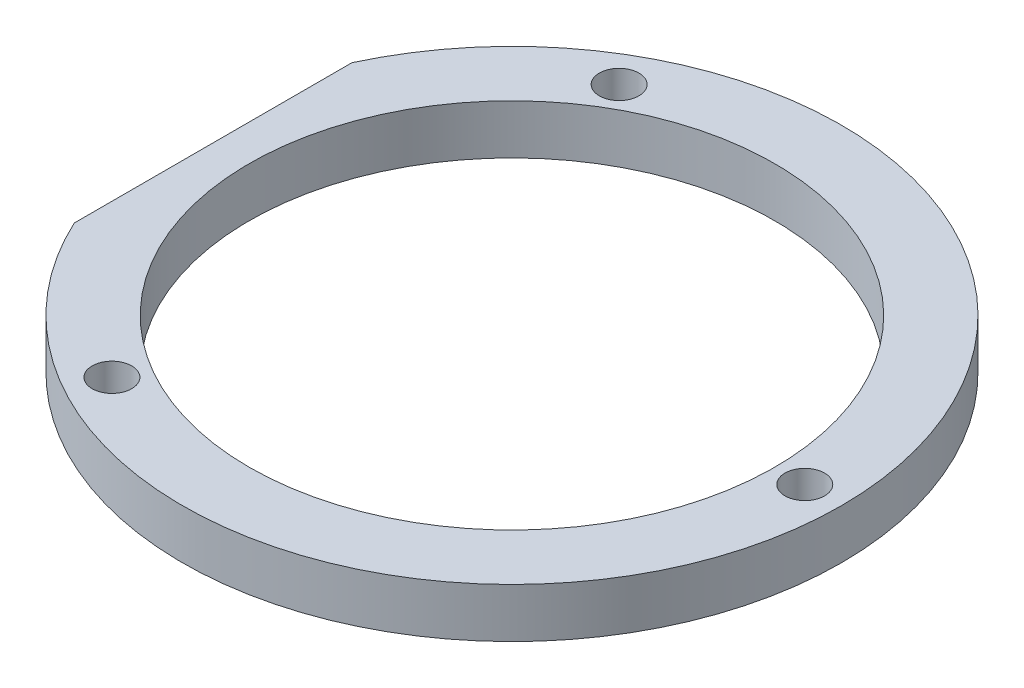
ISO-10303-21;
HEADER;
FILE_DESCRIPTION(('STEP AP214'),'2;1');
FILE_NAME('part.step','',(''),(''),'','','');
FILE_SCHEMA(('AUTOMOTIVE_DESIGN { 1 0 10303 214 1 1 1 1 }'));
ENDSEC;
DATA;
#1=APPLICATION_CONTEXT('core data for automotive mechanical design processes');
#2=APPLICATION_PROTOCOL_DEFINITION('international standard','automotive_design',2000,#1);
#3=PRODUCT_CONTEXT('',#1,'mechanical');
#4=PRODUCT('Part','Part','',(#3));
#5=PRODUCT_RELATED_PRODUCT_CATEGORY('part','',(#4));
#6=PRODUCT_DEFINITION_FORMATION('','',#4);
#7=PRODUCT_DEFINITION_CONTEXT('part definition',#1,'design');
#8=PRODUCT_DEFINITION('design','',#6,#7);
#9=PRODUCT_DEFINITION_SHAPE('','',#8);
#10=(LENGTH_UNIT() NAMED_UNIT(*) SI_UNIT(.MILLI.,.METRE.));
#11=(NAMED_UNIT(*) PLANE_ANGLE_UNIT() SI_UNIT($,.RADIAN.));
#12=(NAMED_UNIT(*) SI_UNIT($,.STERADIAN.) SOLID_ANGLE_UNIT());
#13=UNCERTAINTY_MEASURE_WITH_UNIT(LENGTH_MEASURE(1.E-05),#10,'distance_accuracy_value','');
#14=(GEOMETRIC_REPRESENTATION_CONTEXT(3) GLOBAL_UNCERTAINTY_ASSIGNED_CONTEXT((#13)) GLOBAL_UNIT_ASSIGNED_CONTEXT((#10,
#11,#12)) REPRESENTATION_CONTEXT('',''));
#15=CARTESIAN_POINT('',(0.,0.,0.));
#16=DIRECTION('',(0.,0.,1.));
#17=DIRECTION('',(1.,0.,0.));
#18=AXIS2_PLACEMENT_3D('',#15,#16,#17);
#19=CARTESIAN_POINT('',(0.,4.,0.));
#20=DIRECTION('',(0.,-1.,0.));
#21=DIRECTION('',(0.,0.,-1.));
#22=AXIS2_PLACEMENT_3D('',#19,#20,#21);
#23=CYLINDRICAL_SURFACE('',#22,26.64);
#24=CARTESIAN_POINT('',(0.,4.,0.));
#25=DIRECTION('',(0.,1.,0.));
#26=DIRECTION('',(0.,0.,1.));
#27=AXIS2_PLACEMENT_3D('',#24,#25,#26);
#28=CIRCLE('',#27,26.64);
#29=CARTESIAN_POINT('',(-24.16,4.,11.22425944105));
#30=VERTEX_POINT('',#29);
#31=CARTESIAN_POINT('',(-24.16,4.,-11.22425944105));
#32=VERTEX_POINT('',#31);
#33=EDGE_CURVE('E42',#30,#32,#28,.T.);
#34=ORIENTED_EDGE('',*,*,#33,.F.);
#35=DIRECTION('',(0.,-1.,0.));
#36=VECTOR('',#35,1.);
#37=CARTESIAN_POINT('',(-24.16,4.,11.22425944105));
#38=LINE('',#37,#36);
#39=CARTESIAN_POINT('',(-24.16,0.,11.22425944105));
#40=VERTEX_POINT('',#39);
#41=EDGE_CURVE('E56',#30,#40,#38,.T.);
#42=ORIENTED_EDGE('',*,*,#41,.T.);
#43=CARTESIAN_POINT('',(0.,0.,0.));
#44=DIRECTION('',(0.,1.,0.));
#45=DIRECTION('',(0.,0.,1.));
#46=AXIS2_PLACEMENT_3D('',#43,#44,#45);
#47=CIRCLE('',#46,26.64);
#48=CARTESIAN_POINT('',(-24.16,0.,-11.22425944105));
#49=VERTEX_POINT('',#48);
#50=EDGE_CURVE('E71',#40,#49,#47,.T.);
#51=ORIENTED_EDGE('',*,*,#50,.T.);
#52=DIRECTION('',(0.,-1.,0.));
#53=VECTOR('',#52,1.);
#54=CARTESIAN_POINT('',(-24.16,4.,-11.22425944105));
#55=LINE('',#54,#53);
#56=EDGE_CURVE('E49',#49,#32,#55,.F.);
#57=ORIENTED_EDGE('',*,*,#56,.T.);
#58=EDGE_LOOP('',(#34,#42,#51,#57));
#59=FACE_BOUND('',#58,.T.);
#60=ADVANCED_FACE('F35',(#59),#23,.T.);
#61=CARTESIAN_POINT('',(0.,4.,0.));
#62=DIRECTION('',(0.,1.,0.));
#63=DIRECTION('',(0.,0.,1.));
#64=AXIS2_PLACEMENT_3D('',#61,#62,#63);
#65=PLANE('',#64);
#66=DIRECTION('',(0.,0.,-1.));
#67=VECTOR('',#66,1.);
#68=CARTESIAN_POINT('',(-24.16,4.,30.8070078708447));
#69=LINE('',#68,#67);
#70=EDGE_CURVE('E59',#30,#32,#69,.T.);
#71=ORIENTED_EDGE('',*,*,#70,.F.);
#72=ORIENTED_EDGE('',*,*,#33,.T.);
#73=EDGE_LOOP('',(#71,#72));
#74=FACE_BOUND('',#73,.T.);
#75=CARTESIAN_POINT('',(-11.836027713626,4.,20.5006013597932));
#76=DIRECTION('',(0.,1.,0.));
#77=DIRECTION('',(-0.866025403784436,0.,-0.500000000000004));
#78=AXIS2_PLACEMENT_3D('',#75,#76,#77);
#79=CIRCLE('',#78,1.6);
#80=CARTESIAN_POINT('',(-13.2216683596811,4.,19.7006013597932));
#81=VERTEX_POINT('',#80);
#82=EDGE_CURVE('E92',#81,#81,#79,.T.);
#83=ORIENTED_EDGE('',*,*,#82,.F.);
#84=EDGE_LOOP('',(#83));
#85=FACE_BOUND('',#84,.T.);
#86=CARTESIAN_POINT('',(-11.8360277136257,4.,-20.5006013597934));
#87=DIRECTION('',(0.,1.,0.));
#88=DIRECTION('',(0.866025403784443,0.,-0.499999999999992));
#89=AXIS2_PLACEMENT_3D('',#86,#87,#88);
#90=CIRCLE('',#89,1.6);
#91=CARTESIAN_POINT('',(-10.4503870675706,4.,-21.3006013597934));
#92=VERTEX_POINT('',#91);
#93=EDGE_CURVE('E64',#92,#92,#90,.T.);
#94=ORIENTED_EDGE('',*,*,#93,.F.);
#95=EDGE_LOOP('',(#94));
#96=FACE_BOUND('',#95,.T.);
#97=CARTESIAN_POINT('',(23.6720554272517,4.,0.));
#98=DIRECTION('',(0.,1.,0.));
#99=DIRECTION('',(0.,0.,1.));
#100=AXIS2_PLACEMENT_3D('',#97,#98,#99);
#101=CIRCLE('',#100,1.6);
#102=CARTESIAN_POINT('',(23.6720554272517,4.,1.6));
#103=VERTEX_POINT('',#102);
#104=EDGE_CURVE('E81',#103,#103,#101,.T.);
#105=ORIENTED_EDGE('',*,*,#104,.F.);
#106=EDGE_LOOP('',(#105));
#107=FACE_BOUND('',#106,.T.);
#108=CARTESIAN_POINT('',(0.,4.,0.));
#109=DIRECTION('',(0.,1.,0.));
#110=DIRECTION('',(0.,0.,1.));
#111=AXIS2_PLACEMENT_3D('',#108,#109,#110);
#112=CIRCLE('',#111,21.25);
#113=CARTESIAN_POINT('',(0.,4.,21.25));
#114=VERTEX_POINT('',#113);
#115=EDGE_CURVE('E75',#114,#114,#112,.T.);
#116=ORIENTED_EDGE('',*,*,#115,.F.);
#117=EDGE_LOOP('',(#116));
#118=FACE_BOUND('',#117,.T.);
#119=ADVANCED_FACE('F68',(#74,#85,#96,#107,#118),#65,.T.);
#120=CARTESIAN_POINT('',(0.,0.,0.));
#121=DIRECTION('',(0.,1.,0.));
#122=DIRECTION('',(0.,0.,1.));
#123=AXIS2_PLACEMENT_3D('',#120,#121,#122);
#124=PLANE('',#123);
#125=CARTESIAN_POINT('',(-11.836027713626,0.,20.5006013597932));
#126=DIRECTION('',(0.,1.,0.));
#127=DIRECTION('',(-0.866025403784436,0.,-0.500000000000004));
#128=AXIS2_PLACEMENT_3D('',#125,#126,#127);
#129=CIRCLE('',#128,1.6);
#130=CARTESIAN_POINT('',(-13.2216683596811,0.,19.7006013597932));
#131=VERTEX_POINT('',#130);
#132=EDGE_CURVE('E84',#131,#131,#129,.T.);
#133=ORIENTED_EDGE('',*,*,#132,.T.);
#134=EDGE_LOOP('',(#133));
#135=FACE_BOUND('',#134,.T.);
#136=CARTESIAN_POINT('',(-11.8360277136257,0.,-20.5006013597934));
#137=DIRECTION('',(0.,1.,0.));
#138=DIRECTION('',(0.866025403784443,0.,-0.499999999999992));
#139=AXIS2_PLACEMENT_3D('',#136,#137,#138);
#140=CIRCLE('',#139,1.6);
#141=CARTESIAN_POINT('',(-10.4503870675706,0.,-21.3006013597934));
#142=VERTEX_POINT('',#141);
#143=EDGE_CURVE('E89',#142,#142,#140,.T.);
#144=ORIENTED_EDGE('',*,*,#143,.T.);
#145=EDGE_LOOP('',(#144));
#146=FACE_BOUND('',#145,.T.);
#147=CARTESIAN_POINT('',(23.6720554272517,0.,0.));
#148=DIRECTION('',(0.,1.,0.));
#149=DIRECTION('',(0.,0.,1.));
#150=AXIS2_PLACEMENT_3D('',#147,#148,#149);
#151=CIRCLE('',#150,1.6);
#152=CARTESIAN_POINT('',(23.6720554272517,0.,1.6));
#153=VERTEX_POINT('',#152);
#154=EDGE_CURVE('E78',#153,#153,#151,.T.);
#155=ORIENTED_EDGE('',*,*,#154,.T.);
#156=EDGE_LOOP('',(#155));
#157=FACE_BOUND('',#156,.T.);
#158=CARTESIAN_POINT('',(0.,0.,0.));
#159=DIRECTION('',(0.,1.,0.));
#160=DIRECTION('',(0.,0.,1.));
#161=AXIS2_PLACEMENT_3D('',#158,#159,#160);
#162=CIRCLE('',#161,21.25);
#163=CARTESIAN_POINT('',(0.,0.,21.25));
#164=VERTEX_POINT('',#163);
#165=EDGE_CURVE('E73',#164,#164,#162,.T.);
#166=ORIENTED_EDGE('',*,*,#165,.T.);
#167=EDGE_LOOP('',(#166));
#168=FACE_BOUND('',#167,.T.);
#169=ORIENTED_EDGE('',*,*,#50,.F.);
#170=DIRECTION('',(0.,0.,-1.));
#171=VECTOR('',#170,1.);
#172=CARTESIAN_POINT('',(-24.16,0.,0.));
#173=LINE('',#172,#171);
#174=EDGE_CURVE('E11',#40,#49,#173,.T.);
#175=ORIENTED_EDGE('',*,*,#174,.T.);
#176=EDGE_LOOP('',(#169,#175));
#177=FACE_BOUND('',#176,.T.);
#178=ADVANCED_FACE('F99',(#135,#146,#157,#168,#177),#124,.F.);
#179=CARTESIAN_POINT('',(0.,0.,0.));
#180=DIRECTION('',(0.,1.,0.));
#181=DIRECTION('',(0.,0.,1.));
#182=AXIS2_PLACEMENT_3D('',#179,#180,#181);
#183=CYLINDRICAL_SURFACE('',#182,21.25);
#184=ORIENTED_EDGE('',*,*,#165,.F.);
#185=EDGE_LOOP('',(#184));
#186=FACE_BOUND('',#185,.T.);
#187=ORIENTED_EDGE('',*,*,#115,.T.);
#188=EDGE_LOOP('',(#187));
#189=FACE_BOUND('',#188,.T.);
#190=ADVANCED_FACE('F117',(#186,#189),#183,.F.);
#191=CARTESIAN_POINT('',(23.6720554272517,0.,0.));
#192=DIRECTION('',(0.,1.,0.));
#193=DIRECTION('',(0.,0.,1.));
#194=AXIS2_PLACEMENT_3D('',#191,#192,#193);
#195=CYLINDRICAL_SURFACE('',#194,1.6);
#196=ORIENTED_EDGE('',*,*,#154,.F.);
#197=EDGE_LOOP('',(#196));
#198=FACE_BOUND('',#197,.T.);
#199=ORIENTED_EDGE('',*,*,#104,.T.);
#200=EDGE_LOOP('',(#199));
#201=FACE_BOUND('',#200,.T.);
#202=ADVANCED_FACE('F119',(#198,#201),#195,.F.);
#203=CARTESIAN_POINT('',(-11.8360277136257,0.,-20.5006013597934));
#204=DIRECTION('',(0.,1.,0.));
#205=DIRECTION('',(0.,0.,1.));
#206=AXIS2_PLACEMENT_3D('',#203,#204,#205);
#207=CYLINDRICAL_SURFACE('',#206,1.6);
#208=ORIENTED_EDGE('',*,*,#143,.F.);
#209=EDGE_LOOP('',(#208));
#210=FACE_BOUND('',#209,.T.);
#211=ORIENTED_EDGE('',*,*,#93,.T.);
#212=EDGE_LOOP('',(#211));
#213=FACE_BOUND('',#212,.T.);
#214=ADVANCED_FACE('F105',(#210,#213),#207,.F.);
#215=CARTESIAN_POINT('',(-11.836027713626,0.,20.5006013597932));
#216=DIRECTION('',(0.,1.,0.));
#217=DIRECTION('',(0.,0.,1.));
#218=AXIS2_PLACEMENT_3D('',#215,#216,#217);
#219=CYLINDRICAL_SURFACE('',#218,1.6);
#220=ORIENTED_EDGE('',*,*,#132,.F.);
#221=EDGE_LOOP('',(#220));
#222=FACE_BOUND('',#221,.T.);
#223=ORIENTED_EDGE('',*,*,#82,.T.);
#224=EDGE_LOOP('',(#223));
#225=FACE_BOUND('',#224,.T.);
#226=ADVANCED_FACE('F102',(#222,#225),#219,.F.);
#227=CARTESIAN_POINT('',(-24.16,0.,30.8070078708447));
#228=DIRECTION('',(1.,0.,0.));
#229=DIRECTION('',(0.,0.,-1.));
#230=AXIS2_PLACEMENT_3D('',#227,#228,#229);
#231=PLANE('',#230);
#232=ORIENTED_EDGE('',*,*,#70,.T.);
#233=ORIENTED_EDGE('',*,*,#56,.F.);
#234=ORIENTED_EDGE('',*,*,#174,.F.);
#235=ORIENTED_EDGE('',*,*,#41,.F.);
#236=EDGE_LOOP('',(#232,#233,#234,#235));
#237=FACE_BOUND('',#236,.T.);
#238=ADVANCED_FACE('F58',(#237),#231,.F.);
#239=CLOSED_SHELL('',(#60,#119,#178,#190,#202,#214,#226,#238));
#240=MANIFOLD_SOLID_BREP('B2',#239);
#241=ADVANCED_BREP_SHAPE_REPRESENTATION('',(#18,#240),#14);
#242=SHAPE_DEFINITION_REPRESENTATION(#9,#241);
ENDSEC;
END-ISO-10303-21;
